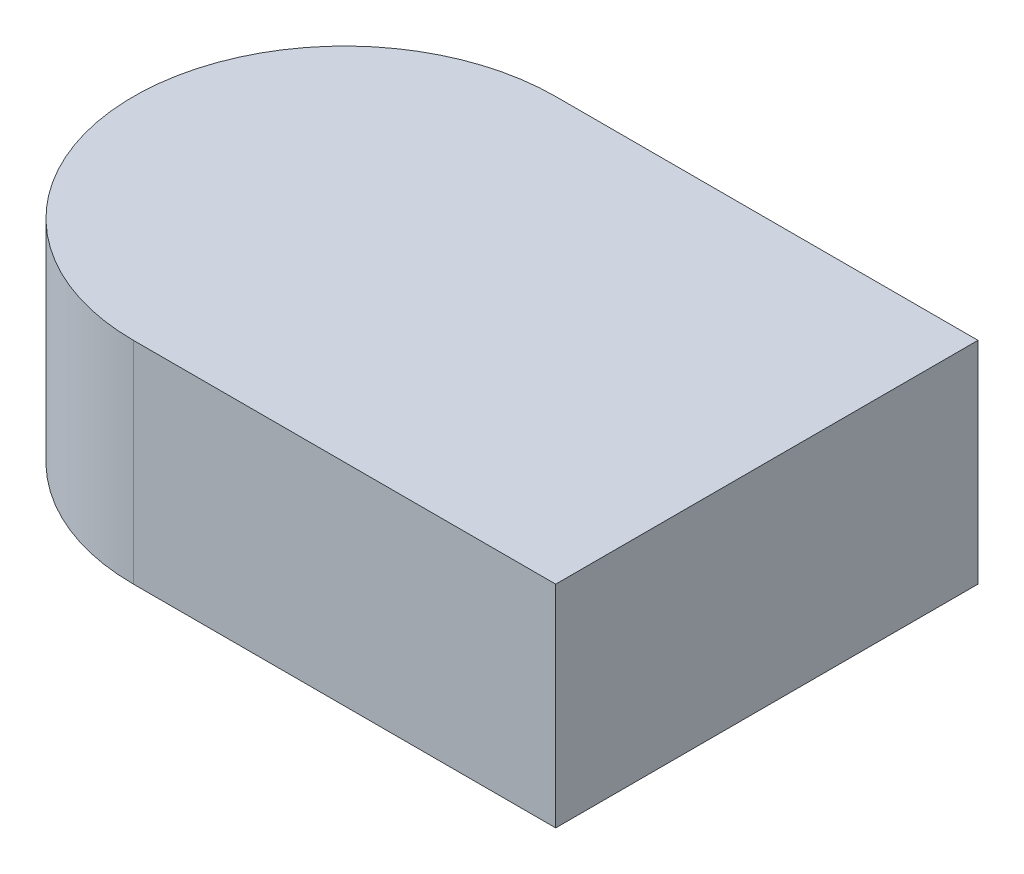
ISO-10303-21;
HEADER;
FILE_DESCRIPTION(('STEP AP214'),'2;1');
FILE_NAME('part.step','',(''),(''),'','','');
FILE_SCHEMA(('AUTOMOTIVE_DESIGN { 1 0 10303 214 1 1 1 1 }'));
ENDSEC;
DATA;
#1=APPLICATION_CONTEXT('core data for automotive mechanical design processes');
#2=APPLICATION_PROTOCOL_DEFINITION('international standard','automotive_design',2000,#1);
#3=PRODUCT_CONTEXT('',#1,'mechanical');
#4=PRODUCT('Part','Part','',(#3));
#5=PRODUCT_RELATED_PRODUCT_CATEGORY('part','',(#4));
#6=PRODUCT_DEFINITION_FORMATION('','',#4);
#7=PRODUCT_DEFINITION_CONTEXT('part definition',#1,'design');
#8=PRODUCT_DEFINITION('design','',#6,#7);
#9=PRODUCT_DEFINITION_SHAPE('','',#8);
#10=(LENGTH_UNIT() NAMED_UNIT(*) SI_UNIT(.MILLI.,.METRE.));
#11=(NAMED_UNIT(*) PLANE_ANGLE_UNIT() SI_UNIT($,.RADIAN.));
#12=(NAMED_UNIT(*) SI_UNIT($,.STERADIAN.) SOLID_ANGLE_UNIT());
#13=UNCERTAINTY_MEASURE_WITH_UNIT(LENGTH_MEASURE(1.E-05),#10,'distance_accuracy_value','');
#14=(GEOMETRIC_REPRESENTATION_CONTEXT(3) GLOBAL_UNCERTAINTY_ASSIGNED_CONTEXT((#13)) GLOBAL_UNIT_ASSIGNED_CONTEXT((#10,
#11,#12)) REPRESENTATION_CONTEXT('',''));
#15=CARTESIAN_POINT('',(0.,0.,0.));
#16=DIRECTION('',(0.,0.,1.));
#17=DIRECTION('',(1.,0.,0.));
#18=AXIS2_PLACEMENT_3D('',#15,#16,#17);
#19=CARTESIAN_POINT('',(0.,0.,0.));
#20=DIRECTION('',(0.,1.,0.));
#21=DIRECTION('',(1.,0.,0.));
#22=AXIS2_PLACEMENT_3D('',#19,#20,#21);
#23=PLANE('',#22);
#24=DIRECTION('',(0.,0.,-1.));
#25=VECTOR('',#24,1.);
#26=CARTESIAN_POINT('',(1.25,0.,0.7));
#27=LINE('',#26,#25);
#28=CARTESIAN_POINT('',(1.25,0.,0.7));
#29=VERTEX_POINT('',#28);
#30=CARTESIAN_POINT('',(1.25,0.,0.5));
#31=VERTEX_POINT('',#30);
#32=EDGE_CURVE('E11',#29,#31,#27,.T.);
#33=ORIENTED_EDGE('',*,*,#32,.F.);
#34=DIRECTION('',(1.,0.,0.));
#35=VECTOR('',#34,1.);
#36=CARTESIAN_POINT('',(1.05,0.,0.7));
#37=LINE('',#36,#35);
#38=CARTESIAN_POINT('',(1.05,0.,0.7));
#39=VERTEX_POINT('',#38);
#40=EDGE_CURVE('E25',#39,#29,#37,.T.);
#41=ORIENTED_EDGE('',*,*,#40,.F.);
#42=CARTESIAN_POINT('',(1.05,0.,0.6));
#43=DIRECTION('',(0.,1.,0.));
#44=DIRECTION('',(0.,0.,-1.));
#45=AXIS2_PLACEMENT_3D('',#42,#43,#44);
#46=CIRCLE('',#45,0.1);
#47=CARTESIAN_POINT('',(1.05,0.,0.5));
#48=VERTEX_POINT('',#47);
#49=EDGE_CURVE('E73',#48,#39,#46,.T.);
#50=ORIENTED_EDGE('',*,*,#49,.F.);
#51=DIRECTION('',(-1.,0.,0.));
#52=VECTOR('',#51,1.);
#53=CARTESIAN_POINT('',(1.25,0.,0.5));
#54=LINE('',#53,#52);
#55=EDGE_CURVE('E99',#31,#48,#54,.T.);
#56=ORIENTED_EDGE('',*,*,#55,.F.);
#57=EDGE_LOOP('',(#33,#41,#50,#56));
#58=FACE_BOUND('',#57,.T.);
#59=ADVANCED_FACE('F17',(#58),#23,.F.);
#60=CARTESIAN_POINT('',(1.25,0.,0.5));
#61=DIRECTION('',(0.,0.,-1.));
#62=DIRECTION('',(-1.,0.,0.));
#63=AXIS2_PLACEMENT_3D('',#60,#61,#62);
#64=PLANE('',#63);
#65=DIRECTION('',(0.,1.,0.));
#66=VECTOR('',#65,1.);
#67=CARTESIAN_POINT('',(1.05,0.,0.5));
#68=LINE('',#67,#66);
#69=CARTESIAN_POINT('',(1.05,0.1,0.5));
#70=VERTEX_POINT('',#69);
#71=EDGE_CURVE('E95',#48,#70,#68,.T.);
#72=ORIENTED_EDGE('',*,*,#71,.T.);
#73=DIRECTION('',(-1.,0.,0.));
#74=VECTOR('',#73,1.);
#75=CARTESIAN_POINT('',(1.25,0.1,0.5));
#76=LINE('',#75,#74);
#77=CARTESIAN_POINT('',(1.25,0.1,0.5));
#78=VERTEX_POINT('',#77);
#79=EDGE_CURVE('E68',#78,#70,#76,.T.);
#80=ORIENTED_EDGE('',*,*,#79,.F.);
#81=DIRECTION('',(0.,1.,0.));
#82=VECTOR('',#81,1.);
#83=CARTESIAN_POINT('',(1.25,0.,0.5));
#84=LINE('',#83,#82);
#85=EDGE_CURVE('E87',#31,#78,#84,.T.);
#86=ORIENTED_EDGE('',*,*,#85,.F.);
#87=ORIENTED_EDGE('',*,*,#55,.T.);
#88=EDGE_LOOP('',(#72,#80,#86,#87));
#89=FACE_BOUND('',#88,.T.);
#90=ADVANCED_FACE('F113',(#89),#64,.T.);
#91=CARTESIAN_POINT('',(1.25,0.,0.7));
#92=DIRECTION('',(1.,0.,0.));
#93=DIRECTION('',(0.,0.,-1.));
#94=AXIS2_PLACEMENT_3D('',#91,#92,#93);
#95=PLANE('',#94);
#96=ORIENTED_EDGE('',*,*,#85,.T.);
#97=DIRECTION('',(0.,0.,-1.));
#98=VECTOR('',#97,1.);
#99=CARTESIAN_POINT('',(1.25,0.1,0.7));
#100=LINE('',#99,#98);
#101=CARTESIAN_POINT('',(1.25,0.1,0.7));
#102=VERTEX_POINT('',#101);
#103=EDGE_CURVE('E83',#102,#78,#100,.T.);
#104=ORIENTED_EDGE('',*,*,#103,.F.);
#105=DIRECTION('',(0.,1.,0.));
#106=VECTOR('',#105,1.);
#107=CARTESIAN_POINT('',(1.25,0.,0.7));
#108=LINE('',#107,#106);
#109=EDGE_CURVE('E60',#29,#102,#108,.T.);
#110=ORIENTED_EDGE('',*,*,#109,.F.);
#111=ORIENTED_EDGE('',*,*,#32,.T.);
#112=EDGE_LOOP('',(#96,#104,#110,#111));
#113=FACE_BOUND('',#112,.T.);
#114=ADVANCED_FACE('F119',(#113),#95,.T.);
#115=CARTESIAN_POINT('',(1.05,0.,0.7));
#116=DIRECTION('',(0.,0.,1.));
#117=DIRECTION('',(1.,0.,0.));
#118=AXIS2_PLACEMENT_3D('',#115,#116,#117);
#119=PLANE('',#118);
#120=ORIENTED_EDGE('',*,*,#109,.T.);
#121=DIRECTION('',(1.,0.,0.));
#122=VECTOR('',#121,1.);
#123=CARTESIAN_POINT('',(1.05,0.1,0.7));
#124=LINE('',#123,#122);
#125=CARTESIAN_POINT('',(1.05,0.1,0.7));
#126=VERTEX_POINT('',#125);
#127=EDGE_CURVE('E54',#126,#102,#124,.T.);
#128=ORIENTED_EDGE('',*,*,#127,.F.);
#129=DIRECTION('',(0.,1.,0.));
#130=VECTOR('',#129,1.);
#131=CARTESIAN_POINT('',(1.05,0.,0.7));
#132=LINE('',#131,#130);
#133=EDGE_CURVE('E58',#39,#126,#132,.T.);
#134=ORIENTED_EDGE('',*,*,#133,.F.);
#135=ORIENTED_EDGE('',*,*,#40,.T.);
#136=EDGE_LOOP('',(#120,#128,#134,#135));
#137=FACE_BOUND('',#136,.T.);
#138=ADVANCED_FACE('F56',(#137),#119,.T.);
#139=CARTESIAN_POINT('',(1.05,0.,0.6));
#140=DIRECTION('',(0.,1.,0.));
#141=DIRECTION('',(1.,0.,0.));
#142=AXIS2_PLACEMENT_3D('',#139,#140,#141);
#143=CYLINDRICAL_SURFACE('',#142,0.1);
#144=ORIENTED_EDGE('',*,*,#133,.T.);
#145=CARTESIAN_POINT('',(1.05,0.1,0.6));
#146=DIRECTION('',(0.,1.,0.));
#147=DIRECTION('',(0.,0.,-1.));
#148=AXIS2_PLACEMENT_3D('',#145,#146,#147);
#149=CIRCLE('',#148,0.1);
#150=EDGE_CURVE('E66',#70,#126,#149,.T.);
#151=ORIENTED_EDGE('',*,*,#150,.F.);
#152=ORIENTED_EDGE('',*,*,#71,.F.);
#153=ORIENTED_EDGE('',*,*,#49,.T.);
#154=EDGE_LOOP('',(#144,#151,#152,#153));
#155=FACE_BOUND('',#154,.T.);
#156=ADVANCED_FACE('F72',(#155),#143,.T.);
#157=CARTESIAN_POINT('',(0.,0.1,0.));
#158=DIRECTION('',(0.,1.,0.));
#159=DIRECTION('',(1.,0.,0.));
#160=AXIS2_PLACEMENT_3D('',#157,#158,#159);
#161=PLANE('',#160);
#162=ORIENTED_EDGE('',*,*,#150,.T.);
#163=ORIENTED_EDGE('',*,*,#127,.T.);
#164=ORIENTED_EDGE('',*,*,#103,.T.);
#165=ORIENTED_EDGE('',*,*,#79,.T.);
#166=EDGE_LOOP('',(#162,#163,#164,#165));
#167=FACE_BOUND('',#166,.T.);
#168=ADVANCED_FACE('F67',(#167),#161,.T.);
#169=CLOSED_SHELL('',(#59,#90,#114,#138,#156,#168));
#170=MANIFOLD_SOLID_BREP('B1',#169);
#171=ADVANCED_BREP_SHAPE_REPRESENTATION('',(#18,#170),#14);
#172=SHAPE_DEFINITION_REPRESENTATION(#9,#171);
ENDSEC;
END-ISO-10303-21;
